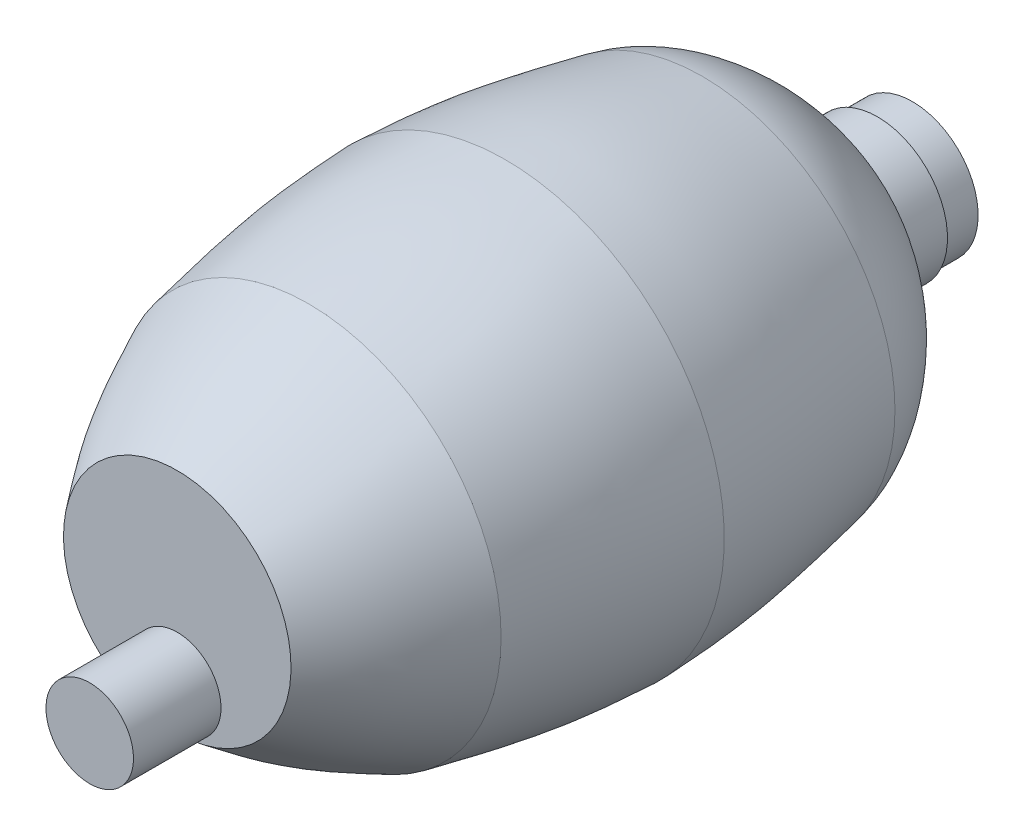
ISO-10303-21;
HEADER;
FILE_DESCRIPTION(('STEP AP214'),'2;1');
FILE_NAME('part.step','',(''),(''),'','','');
FILE_SCHEMA(('AUTOMOTIVE_DESIGN { 1 0 10303 214 1 1 1 1 }'));
ENDSEC;
DATA;
#1=APPLICATION_CONTEXT('core data for automotive mechanical design processes');
#2=APPLICATION_PROTOCOL_DEFINITION('international standard','automotive_design',2000,#1);
#3=PRODUCT_CONTEXT('',#1,'mechanical');
#4=PRODUCT('Part','Part','',(#3));
#5=PRODUCT_RELATED_PRODUCT_CATEGORY('part','',(#4));
#6=PRODUCT_DEFINITION_FORMATION('','',#4);
#7=PRODUCT_DEFINITION_CONTEXT('part definition',#1,'design');
#8=PRODUCT_DEFINITION('design','',#6,#7);
#9=PRODUCT_DEFINITION_SHAPE('','',#8);
#10=(LENGTH_UNIT() NAMED_UNIT(*) SI_UNIT(.MILLI.,.METRE.));
#11=(NAMED_UNIT(*) PLANE_ANGLE_UNIT() SI_UNIT($,.RADIAN.));
#12=(NAMED_UNIT(*) SI_UNIT($,.STERADIAN.) SOLID_ANGLE_UNIT());
#13=UNCERTAINTY_MEASURE_WITH_UNIT(LENGTH_MEASURE(1.E-05),#10,'distance_accuracy_value','');
#14=(GEOMETRIC_REPRESENTATION_CONTEXT(3) GLOBAL_UNCERTAINTY_ASSIGNED_CONTEXT((#13)) GLOBAL_UNIT_ASSIGNED_CONTEXT((#10,
#11,#12)) REPRESENTATION_CONTEXT('',''));
#15=CARTESIAN_POINT('',(0.,0.,0.));
#16=DIRECTION('',(0.,0.,1.));
#17=DIRECTION('',(1.,0.,0.));
#18=AXIS2_PLACEMENT_3D('',#15,#16,#17);
#19=CARTESIAN_POINT('',(0.,0.,95.25));
#20=DIRECTION('',(0.,0.,-1.));
#21=DIRECTION('',(-1.,0.,0.));
#22=AXIS2_PLACEMENT_3D('',#19,#20,#21);
#23=PLANE('',#22);
#24=CARTESIAN_POINT('',(0.,0.,95.25));
#25=DIRECTION('',(0.,0.,-1.));
#26=DIRECTION('',(-1.,0.,0.));
#27=AXIS2_PLACEMENT_3D('',#24,#25,#26);
#28=CIRCLE('',#27,33.02);
#29=CARTESIAN_POINT('',(0.,-33.02,95.25));
#30=VERTEX_POINT('',#29);
#31=EDGE_CURVE('E11',#30,#30,#28,.T.);
#32=ORIENTED_EDGE('',*,*,#31,.F.);
#33=CARTESIAN_POINT('',(0.,-20.32,95.25));
#34=DIRECTION('',(0.,0.,1.));
#35=DIRECTION('',(1.,0.,0.));
#36=AXIS2_PLACEMENT_3D('',#33,#34,#35);
#37=CIRCLE('',#36,12.7);
#38=EDGE_CURVE('E44',#30,#30,#37,.T.);
#39=ORIENTED_EDGE('',*,*,#38,.F.);
#40=EDGE_LOOP('',(#32,#39));
#41=FACE_BOUND('',#40,.T.);
#42=ADVANCED_FACE('F32',(#41),#23,.F.);
#43=CARTESIAN_POINT('',(19.05,0.,-118.11));
#44=DIRECTION('',(0.,0.,1.));
#45=DIRECTION('',(1.,0.,0.));
#46=AXIS2_PLACEMENT_3D('',#43,#44,#45);
#47=PLANE('',#46);
#48=CARTESIAN_POINT('',(0.,0.,-118.11));
#49=DIRECTION('',(0.,0.,-1.));
#50=DIRECTION('',(-1.,0.,0.));
#51=AXIS2_PLACEMENT_3D('',#48,#49,#50);
#52=CIRCLE('',#51,19.05);
#53=CARTESIAN_POINT('',(-19.0500000000001,0.,-118.11));
#54=VERTEX_POINT('',#53);
#55=EDGE_CURVE('E161',#54,#54,#52,.T.);
#56=ORIENTED_EDGE('',*,*,#55,.T.);
#57=EDGE_LOOP('',(#56));
#58=FACE_BOUND('',#57,.T.);
#59=ADVANCED_FACE('F34',(#58),#47,.F.);
#60=CARTESIAN_POINT('',(33.02,0.,95.25));
#61=CARTESIAN_POINT('',(36.9943346591665,0.,89.9893504800427));
#62=CARTESIAN_POINT('',(45.9655622436134,0.,78.1145366727306));
#63=CARTESIAN_POINT('',(52.3332534030959,0.,64.6497595352071));
#64=CARTESIAN_POINT('',(55.88,0.,57.15));
#65=B_SPLINE_CURVE_WITH_KNOTS('',3,(#60,#61,#62,#63,#64),.UNSPECIFIED.,.F.,.F.,(4,1,4),(0.,
0.443009010947021,1.),.UNSPECIFIED.);
#66=CARTESIAN_POINT('',(0.,0.,-95.25));
#67=DIRECTION('',(0.,0.,-1.));
#68=AXIS1_PLACEMENT('',#66,#67);
#69=SURFACE_OF_REVOLUTION('',#65,#68);
#70=CARTESIAN_POINT('',(0.,0.,57.15));
#71=DIRECTION('',(0.,0.,-1.));
#72=DIRECTION('',(-1.,0.,0.));
#73=AXIS2_PLACEMENT_3D('',#70,#71,#72);
#74=CIRCLE('',#73,55.88);
#75=CARTESIAN_POINT('',(-55.88,0.,57.15));
#76=VERTEX_POINT('',#75);
#77=EDGE_CURVE('E39',#76,#76,#74,.T.);
#78=ORIENTED_EDGE('',*,*,#77,.F.);
#79=EDGE_LOOP('',(#78));
#80=FACE_BOUND('',#79,.T.);
#81=ORIENTED_EDGE('',*,*,#31,.T.);
#82=EDGE_LOOP('',(#81));
#83=FACE_BOUND('',#82,.T.);
#84=ADVANCED_FACE('F46',(#80,#83),#69,.T.);
#85=CARTESIAN_POINT('',(55.88,0.,57.15));
#86=CARTESIAN_POINT('',(58.4183454972116,0.,44.4990748199973));
#87=CARTESIAN_POINT('',(62.2113742071975,0.,25.5949018189828));
#88=CARTESIAN_POINT('',(63.1796930620214,0.,6.36199017223718));
#89=CARTESIAN_POINT('',(63.5,0.,0.));
#90=B_SPLINE_CURVE_WITH_KNOTS('',3,(#85,#86,#87,#88,#89),.UNSPECIFIED.,.F.,.F.,(4,1,4),(0.,
0.669213362537664,1.),.UNSPECIFIED.);
#91=CARTESIAN_POINT('',(0.,0.,-95.25));
#92=DIRECTION('',(0.,0.,-1.));
#93=AXIS1_PLACEMENT('',#91,#92);
#94=SURFACE_OF_REVOLUTION('',#90,#93);
#95=CARTESIAN_POINT('',(0.,0.,0.));
#96=DIRECTION('',(0.,0.,-1.));
#97=DIRECTION('',(-1.,0.,0.));
#98=AXIS2_PLACEMENT_3D('',#95,#96,#97);
#99=CIRCLE('',#98,63.5);
#100=CARTESIAN_POINT('',(-63.5,0.,0.));
#101=VERTEX_POINT('',#100);
#102=EDGE_CURVE('E180',#101,#101,#99,.T.);
#103=ORIENTED_EDGE('',*,*,#102,.F.);
#104=EDGE_LOOP('',(#103));
#105=FACE_BOUND('',#104,.T.);
#106=ORIENTED_EDGE('',*,*,#77,.T.);
#107=EDGE_LOOP('',(#106));
#108=FACE_BOUND('',#107,.T.);
#109=ADVANCED_FACE('F48',(#105,#108),#94,.T.);
#110=CARTESIAN_POINT('',(63.5,0.,0.));
#111=CARTESIAN_POINT('',(63.1796930620214,0.,-6.36199017223718));
#112=CARTESIAN_POINT('',(62.2113742071975,0.,-25.5949018189828));
#113=CARTESIAN_POINT('',(58.4183454972116,0.,-44.4990748199973));
#114=CARTESIAN_POINT('',(55.88,0.,-57.15));
#115=B_SPLINE_CURVE_WITH_KNOTS('',3,(#110,#111,#112,#113,#114),.UNSPECIFIED.,.F.,.F.,(4,1,4),
(0.,0.330786637462336,1.),.UNSPECIFIED.);
#116=CARTESIAN_POINT('',(0.,0.,-95.25));
#117=DIRECTION('',(0.,0.,-1.));
#118=AXIS1_PLACEMENT('',#116,#117);
#119=SURFACE_OF_REVOLUTION('',#115,#118);
#120=CARTESIAN_POINT('',(0.,0.,-57.15));
#121=DIRECTION('',(0.,0.,-1.));
#122=DIRECTION('',(-1.,0.,0.));
#123=AXIS2_PLACEMENT_3D('',#120,#121,#122);
#124=CIRCLE('',#123,55.88);
#125=CARTESIAN_POINT('',(-55.8800000000001,0.,-57.15));
#126=VERTEX_POINT('',#125);
#127=EDGE_CURVE('E177',#126,#126,#124,.T.);
#128=ORIENTED_EDGE('',*,*,#127,.F.);
#129=EDGE_LOOP('',(#128));
#130=FACE_BOUND('',#129,.T.);
#131=ORIENTED_EDGE('',*,*,#102,.T.);
#132=EDGE_LOOP('',(#131));
#133=FACE_BOUND('',#132,.T.);
#134=ADVANCED_FACE('F55',(#130,#133),#119,.T.);
#135=CARTESIAN_POINT('',(55.88,0.,-57.15));
#136=CARTESIAN_POINT('',(54.0755149658879,0.,-66.1434192095065));
#137=CARTESIAN_POINT('',(42.5639065979441,0.,-82.4104148309382));
#138=CARTESIAN_POINT('',(27.2639831039677,0.,-91.241807370556));
#139=CARTESIAN_POINT('',(20.32,0.,-95.25));
#140=B_SPLINE_CURVE_WITH_KNOTS('',3,(#135,#136,#137,#138,#139),.UNSPECIFIED.,.F.,.F.,(4,1,4),
(0.,0.546142625699955,1.),.UNSPECIFIED.);
#141=CARTESIAN_POINT('',(0.,0.,-95.25));
#142=DIRECTION('',(0.,0.,-1.));
#143=AXIS1_PLACEMENT('',#141,#142);
#144=SURFACE_OF_REVOLUTION('',#140,#143);
#145=CARTESIAN_POINT('',(0.,0.,-95.25));
#146=DIRECTION('',(0.,0.,-1.));
#147=DIRECTION('',(-1.,0.,0.));
#148=AXIS2_PLACEMENT_3D('',#145,#146,#147);
#149=CIRCLE('',#148,20.32);
#150=CARTESIAN_POINT('',(-20.32,0.,-95.25));
#151=VERTEX_POINT('',#150);
#152=EDGE_CURVE('E174',#151,#151,#149,.T.);
#153=ORIENTED_EDGE('',*,*,#152,.F.);
#154=EDGE_LOOP('',(#153));
#155=FACE_BOUND('',#154,.T.);
#156=ORIENTED_EDGE('',*,*,#127,.T.);
#157=EDGE_LOOP('',(#156));
#158=FACE_BOUND('',#157,.T.);
#159=ADVANCED_FACE('F85',(#155,#158),#144,.T.);
#160=CARTESIAN_POINT('',(0.,0.,-95.25));
#161=DIRECTION('',(0.,0.,-1.));
#162=DIRECTION('',(-1.,0.,0.));
#163=AXIS2_PLACEMENT_3D('',#160,#161,#162);
#164=CYLINDRICAL_SURFACE('',#163,20.32);
#165=CARTESIAN_POINT('',(0.,0.,-107.95));
#166=DIRECTION('',(0.,0.,-1.));
#167=DIRECTION('',(-1.,0.,0.));
#168=AXIS2_PLACEMENT_3D('',#165,#166,#167);
#169=CIRCLE('',#168,20.32);
#170=CARTESIAN_POINT('',(-20.32,0.,-107.95));
#171=VERTEX_POINT('',#170);
#172=EDGE_CURVE('E171',#171,#171,#169,.T.);
#173=ORIENTED_EDGE('',*,*,#172,.F.);
#174=EDGE_LOOP('',(#173));
#175=FACE_BOUND('',#174,.T.);
#176=ORIENTED_EDGE('',*,*,#152,.T.);
#177=EDGE_LOOP('',(#176));
#178=FACE_BOUND('',#177,.T.);
#179=ADVANCED_FACE('F95',(#175,#178),#164,.T.);
#180=CARTESIAN_POINT('',(20.32,0.,-107.95));
#181=DIRECTION('',(0.,0.,1.));
#182=DIRECTION('',(1.,0.,0.));
#183=AXIS2_PLACEMENT_3D('',#180,#181,#182);
#184=PLANE('',#183);
#185=CARTESIAN_POINT('',(0.,0.,-107.95));
#186=DIRECTION('',(0.,0.,-1.));
#187=DIRECTION('',(-1.,0.,0.));
#188=AXIS2_PLACEMENT_3D('',#185,#186,#187);
#189=CIRCLE('',#188,19.05);
#190=CARTESIAN_POINT('',(-19.0500000000001,0.,-107.95));
#191=VERTEX_POINT('',#190);
#192=EDGE_CURVE('E167',#191,#191,#189,.T.);
#193=ORIENTED_EDGE('',*,*,#192,.F.);
#194=EDGE_LOOP('',(#193));
#195=FACE_BOUND('',#194,.T.);
#196=ORIENTED_EDGE('',*,*,#172,.T.);
#197=EDGE_LOOP('',(#196));
#198=FACE_BOUND('',#197,.T.);
#199=ADVANCED_FACE('F105',(#195,#198),#184,.F.);
#200=CARTESIAN_POINT('',(0.,0.,-95.25));
#201=DIRECTION('',(0.,0.,-1.));
#202=DIRECTION('',(-1.,0.,0.));
#203=AXIS2_PLACEMENT_3D('',#200,#201,#202);
#204=CYLINDRICAL_SURFACE('',#203,19.05);
#205=ORIENTED_EDGE('',*,*,#55,.F.);
#206=EDGE_LOOP('',(#205));
#207=FACE_BOUND('',#206,.T.);
#208=ORIENTED_EDGE('',*,*,#192,.T.);
#209=EDGE_LOOP('',(#208));
#210=FACE_BOUND('',#209,.T.);
#211=ADVANCED_FACE('F114',(#207,#210),#204,.T.);
#212=CARTESIAN_POINT('',(0.,-20.32,120.65));
#213=DIRECTION('',(0.,0.,-1.));
#214=DIRECTION('',(-1.,0.,0.));
#215=AXIS2_PLACEMENT_3D('',#212,#213,#214);
#216=CYLINDRICAL_SURFACE('',#215,12.7);
#217=CARTESIAN_POINT('',(0.,-20.32,120.65));
#218=DIRECTION('',(0.,0.,1.));
#219=DIRECTION('',(1.,0.,0.));
#220=AXIS2_PLACEMENT_3D('',#217,#218,#219);
#221=CIRCLE('',#220,12.7);
#222=CARTESIAN_POINT('',(12.7,-20.32,120.65));
#223=VERTEX_POINT('',#222);
#224=EDGE_CURVE('E168',#223,#223,#221,.T.);
#225=ORIENTED_EDGE('',*,*,#224,.F.);
#226=EDGE_LOOP('',(#225));
#227=FACE_BOUND('',#226,.T.);
#228=ORIENTED_EDGE('',*,*,#38,.T.);
#229=EDGE_LOOP('',(#228));
#230=FACE_BOUND('',#229,.T.);
#231=ADVANCED_FACE('F123',(#227,#230),#216,.T.);
#232=CARTESIAN_POINT('',(0.,-20.32,120.65));
#233=DIRECTION('',(0.,0.,1.));
#234=DIRECTION('',(1.,0.,0.));
#235=AXIS2_PLACEMENT_3D('',#232,#233,#234);
#236=PLANE('',#235);
#237=ORIENTED_EDGE('',*,*,#224,.T.);
#238=EDGE_LOOP('',(#237));
#239=FACE_BOUND('',#238,.T.);
#240=ADVANCED_FACE('F133',(#239),#236,.T.);
#241=CLOSED_SHELL('',(#42,#59,#84,#109,#134,#159,#179,#199,#211,#231,#240));
#242=MANIFOLD_SOLID_BREP('B2',#241);
#243=ADVANCED_BREP_SHAPE_REPRESENTATION('',(#18,#242),#14);
#244=SHAPE_DEFINITION_REPRESENTATION(#9,#243);
ENDSEC;
END-ISO-10303-21;
